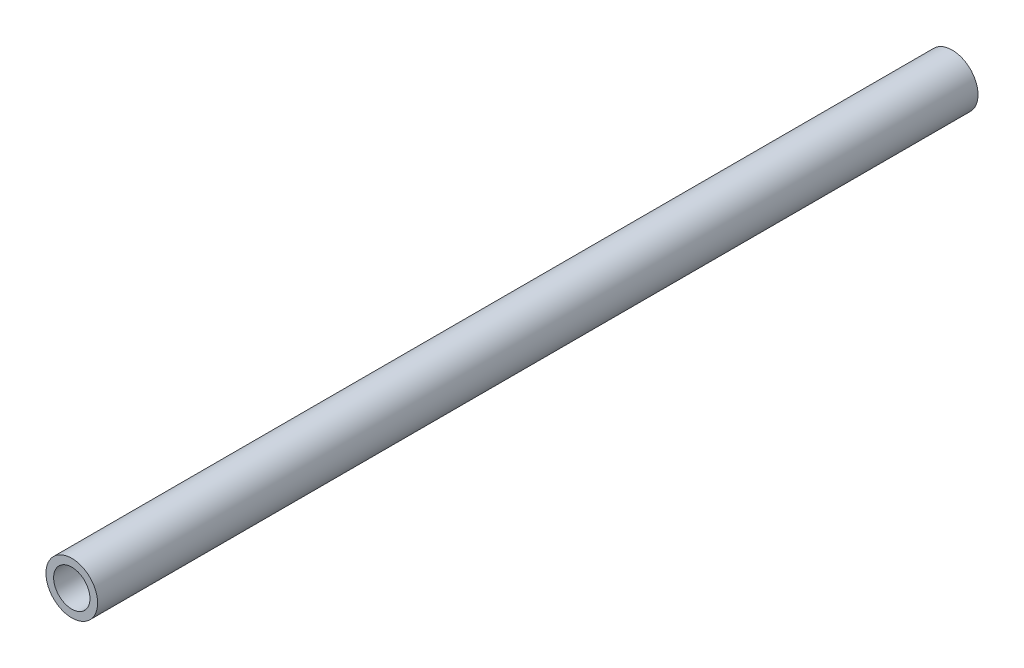
ISO-10303-21;
HEADER;
FILE_DESCRIPTION(('STEP AP214'),'2;1');
FILE_NAME('part.step','',(''),(''),'','','');
FILE_SCHEMA(('AUTOMOTIVE_DESIGN { 1 0 10303 214 1 1 1 1 }'));
ENDSEC;
DATA;
#1=APPLICATION_CONTEXT('core data for automotive mechanical design processes');
#2=APPLICATION_PROTOCOL_DEFINITION('international standard','automotive_design',2000,#1);
#3=PRODUCT_CONTEXT('',#1,'mechanical');
#4=PRODUCT('Part','Part','',(#3));
#5=PRODUCT_RELATED_PRODUCT_CATEGORY('part','',(#4));
#6=PRODUCT_DEFINITION_FORMATION('','',#4);
#7=PRODUCT_DEFINITION_CONTEXT('part definition',#1,'design');
#8=PRODUCT_DEFINITION('design','',#6,#7);
#9=PRODUCT_DEFINITION_SHAPE('','',#8);
#10=(LENGTH_UNIT() NAMED_UNIT(*) SI_UNIT(.MILLI.,.METRE.));
#11=(NAMED_UNIT(*) PLANE_ANGLE_UNIT() SI_UNIT($,.RADIAN.));
#12=(NAMED_UNIT(*) SI_UNIT($,.STERADIAN.) SOLID_ANGLE_UNIT());
#13=UNCERTAINTY_MEASURE_WITH_UNIT(LENGTH_MEASURE(1.E-05),#10,'distance_accuracy_value','');
#14=(GEOMETRIC_REPRESENTATION_CONTEXT(3) GLOBAL_UNCERTAINTY_ASSIGNED_CONTEXT((#13)) GLOBAL_UNIT_ASSIGNED_CONTEXT((#10,
#11,#12)) REPRESENTATION_CONTEXT('',''));
#15=CARTESIAN_POINT('',(0.,0.,0.));
#16=DIRECTION('',(0.,0.,1.));
#17=DIRECTION('',(1.,0.,0.));
#18=AXIS2_PLACEMENT_3D('',#15,#16,#17);
#19=CARTESIAN_POINT('',(347.5,-19.9999999999998,498.183766184074));
#20=DIRECTION('',(0.,0.,-1.));
#21=DIRECTION('',(-1.,0.,0.));
#22=AXIS2_PLACEMENT_3D('',#19,#20,#21);
#23=CYLINDRICAL_SURFACE('',#22,13.5);
#24=CARTESIAN_POINT('',(347.5,-19.9999999999998,0.));
#25=DIRECTION('',(0.,0.,1.));
#26=DIRECTION('',(1.,0.,0.));
#27=AXIS2_PLACEMENT_3D('',#24,#25,#26);
#28=CIRCLE('',#27,13.5);
#29=CARTESIAN_POINT('',(361.,-19.9999999999998,0.));
#30=VERTEX_POINT('',#29);
#31=EDGE_CURVE('E41',#30,#30,#28,.T.);
#32=ORIENTED_EDGE('',*,*,#31,.T.);
#33=EDGE_LOOP('',(#32));
#34=FACE_BOUND('',#33,.T.);
#35=CARTESIAN_POINT('',(347.5,-19.9999999999998,460.));
#36=DIRECTION('',(0.,0.,1.));
#37=DIRECTION('',(1.,0.,0.));
#38=AXIS2_PLACEMENT_3D('',#35,#36,#37);
#39=CIRCLE('',#38,13.5);
#40=CARTESIAN_POINT('',(361.,-19.9999999999998,460.));
#41=VERTEX_POINT('',#40);
#42=EDGE_CURVE('E10',#41,#41,#39,.T.);
#43=ORIENTED_EDGE('',*,*,#42,.F.);
#44=EDGE_LOOP('',(#43));
#45=FACE_BOUND('',#44,.T.);
#46=ADVANCED_FACE('F30',(#34,#45),#23,.T.);
#47=CARTESIAN_POINT('',(347.5,-19.9999999999998,0.));
#48=DIRECTION('',(0.,0.,1.));
#49=DIRECTION('',(1.,0.,0.));
#50=AXIS2_PLACEMENT_3D('',#47,#48,#49);
#51=PLANE('',#50);
#52=ORIENTED_EDGE('',*,*,#31,.F.);
#53=EDGE_LOOP('',(#52));
#54=FACE_BOUND('',#53,.T.);
#55=CARTESIAN_POINT('',(347.5,-19.9999999999998,0.));
#56=DIRECTION('',(0.,0.,1.));
#57=DIRECTION('',(1.,0.,0.));
#58=AXIS2_PLACEMENT_3D('',#55,#56,#57);
#59=CIRCLE('',#58,9.50000000000001);
#60=CARTESIAN_POINT('',(357.,-19.9999999999998,0.));
#61=VERTEX_POINT('',#60);
#62=EDGE_CURVE('E43',#61,#61,#59,.T.);
#63=ORIENTED_EDGE('',*,*,#62,.T.);
#64=EDGE_LOOP('',(#63));
#65=FACE_BOUND('',#64,.T.);
#66=ADVANCED_FACE('F50',(#54,#65),#51,.F.);
#67=CARTESIAN_POINT('',(347.5,-19.9999999999998,498.183766184074));
#68=DIRECTION('',(0.,0.,-1.));
#69=DIRECTION('',(-1.,0.,0.));
#70=AXIS2_PLACEMENT_3D('',#67,#68,#69);
#71=CYLINDRICAL_SURFACE('',#70,9.50000000000001);
#72=ORIENTED_EDGE('',*,*,#62,.F.);
#73=EDGE_LOOP('',(#72));
#74=FACE_BOUND('',#73,.T.);
#75=CARTESIAN_POINT('',(347.5,-19.9999999999998,460.));
#76=DIRECTION('',(0.,0.,1.));
#77=DIRECTION('',(1.,0.,0.));
#78=AXIS2_PLACEMENT_3D('',#75,#76,#77);
#79=CIRCLE('',#78,9.50000000000001);
#80=CARTESIAN_POINT('',(357.,-19.9999999999998,460.));
#81=VERTEX_POINT('',#80);
#82=EDGE_CURVE('E33',#81,#81,#79,.T.);
#83=ORIENTED_EDGE('',*,*,#82,.T.);
#84=EDGE_LOOP('',(#83));
#85=FACE_BOUND('',#84,.T.);
#86=ADVANCED_FACE('F53',(#74,#85),#71,.F.);
#87=CARTESIAN_POINT('',(0.,-40.,460.));
#88=DIRECTION('',(0.,0.,1.));
#89=DIRECTION('',(-1.,0.,0.));
#90=AXIS2_PLACEMENT_3D('',#87,#88,#89);
#91=PLANE('',#90);
#92=ORIENTED_EDGE('',*,*,#82,.F.);
#93=EDGE_LOOP('',(#92));
#94=FACE_BOUND('',#93,.T.);
#95=ORIENTED_EDGE('',*,*,#42,.T.);
#96=EDGE_LOOP('',(#95));
#97=FACE_BOUND('',#96,.T.);
#98=ADVANCED_FACE('F58',(#94,#97),#91,.T.);
#99=CLOSED_SHELL('',(#46,#66,#86,#98));
#100=MANIFOLD_SOLID_BREP('B2',#99);
#101=ADVANCED_BREP_SHAPE_REPRESENTATION('',(#18,#100),#14);
#102=SHAPE_DEFINITION_REPRESENTATION(#9,#101);
ENDSEC;
END-ISO-10303-21;
